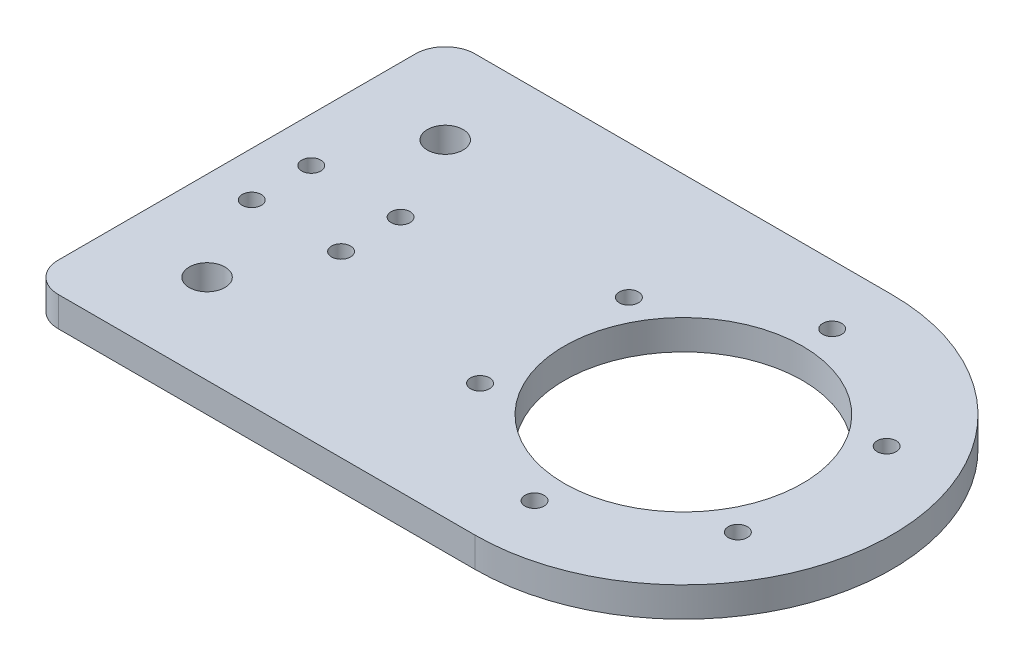
ISO-10303-21;
HEADER;
FILE_DESCRIPTION(('STEP AP214'),'2;1');
FILE_NAME('part.step','',(''),(''),'','','');
FILE_SCHEMA(('AUTOMOTIVE_DESIGN { 1 0 10303 214 1 1 1 1 }'));
ENDSEC;
DATA;
#1=APPLICATION_CONTEXT('core data for automotive mechanical design processes');
#2=APPLICATION_PROTOCOL_DEFINITION('international standard','automotive_design',2000,#1);
#3=PRODUCT_CONTEXT('',#1,'mechanical');
#4=PRODUCT('Part','Part','',(#3));
#5=PRODUCT_RELATED_PRODUCT_CATEGORY('part','',(#4));
#6=PRODUCT_DEFINITION_FORMATION('','',#4);
#7=PRODUCT_DEFINITION_CONTEXT('part definition',#1,'design');
#8=PRODUCT_DEFINITION('design','',#6,#7);
#9=PRODUCT_DEFINITION_SHAPE('','',#8);
#10=(LENGTH_UNIT() NAMED_UNIT(*) SI_UNIT(.MILLI.,.METRE.));
#11=(NAMED_UNIT(*) PLANE_ANGLE_UNIT() SI_UNIT($,.RADIAN.));
#12=(NAMED_UNIT(*) SI_UNIT($,.STERADIAN.) SOLID_ANGLE_UNIT());
#13=UNCERTAINTY_MEASURE_WITH_UNIT(LENGTH_MEASURE(1.E-05),#10,'distance_accuracy_value','');
#14=(GEOMETRIC_REPRESENTATION_CONTEXT(3) GLOBAL_UNCERTAINTY_ASSIGNED_CONTEXT((#13)) GLOBAL_UNIT_ASSIGNED_CONTEXT((#10,
#11,#12)) REPRESENTATION_CONTEXT('',''));
#15=CARTESIAN_POINT('',(0.,0.,0.));
#16=DIRECTION('',(0.,0.,1.));
#17=DIRECTION('',(1.,0.,0.));
#18=AXIS2_PLACEMENT_3D('',#15,#16,#17);
#19=CARTESIAN_POINT('',(0.,5.,-25.));
#20=DIRECTION('',(0.,-1.,0.));
#21=DIRECTION('',(0.,0.,-1.));
#22=AXIS2_PLACEMENT_3D('',#19,#20,#21);
#23=CYLINDRICAL_SURFACE('',#22,1.6);
#24=CARTESIAN_POINT('',(0.,5.,-25.));
#25=DIRECTION('',(0.,1.,0.));
#26=DIRECTION('',(0.,0.,1.));
#27=AXIS2_PLACEMENT_3D('',#24,#25,#26);
#28=CIRCLE('',#27,1.6);
#29=CARTESIAN_POINT('',(0.,5.,-23.4));
#30=VERTEX_POINT('',#29);
#31=EDGE_CURVE('E119',#30,#30,#28,.T.);
#32=ORIENTED_EDGE('',*,*,#31,.T.);
#33=EDGE_LOOP('',(#32));
#34=FACE_BOUND('',#33,.T.);
#35=CARTESIAN_POINT('',(0.,1.5,-25.));
#36=DIRECTION('',(0.,-1.,0.));
#37=DIRECTION('',(0.,0.,-1.));
#38=AXIS2_PLACEMENT_3D('',#35,#36,#37);
#39=CIRCLE('',#38,1.6);
#40=CARTESIAN_POINT('',(0.,1.5,-26.6));
#41=VERTEX_POINT('',#40);
#42=EDGE_CURVE('E37',#41,#41,#39,.T.);
#43=ORIENTED_EDGE('',*,*,#42,.T.);
#44=EDGE_LOOP('',(#43));
#45=FACE_BOUND('',#44,.T.);
#46=ADVANCED_FACE('F33',(#34,#45),#23,.F.);
#47=CARTESIAN_POINT('',(21.650635094611,5.,-12.5));
#48=DIRECTION('',(0.,-1.,0.));
#49=DIRECTION('',(0.,0.,-1.));
#50=AXIS2_PLACEMENT_3D('',#47,#48,#49);
#51=CYLINDRICAL_SURFACE('',#50,1.6);
#52=CARTESIAN_POINT('',(21.650635094611,5.,-12.5));
#53=DIRECTION('',(0.,1.,0.));
#54=DIRECTION('',(0.,0.,1.));
#55=AXIS2_PLACEMENT_3D('',#52,#53,#54);
#56=CIRCLE('',#55,1.6);
#57=CARTESIAN_POINT('',(21.650635094611,5.,-10.8999999999999));
#58=VERTEX_POINT('',#57);
#59=EDGE_CURVE('E208',#58,#58,#56,.T.);
#60=ORIENTED_EDGE('',*,*,#59,.T.);
#61=EDGE_LOOP('',(#60));
#62=FACE_BOUND('',#61,.T.);
#63=CARTESIAN_POINT('',(21.650635094611,1.5,-12.5));
#64=DIRECTION('',(0.,-1.,0.));
#65=DIRECTION('',(0.,0.,-1.));
#66=AXIS2_PLACEMENT_3D('',#63,#64,#65);
#67=CIRCLE('',#66,1.6);
#68=CARTESIAN_POINT('',(21.650635094611,1.5,-14.1));
#69=VERTEX_POINT('',#68);
#70=EDGE_CURVE('E149',#69,#69,#67,.T.);
#71=ORIENTED_EDGE('',*,*,#70,.T.);
#72=EDGE_LOOP('',(#71));
#73=FACE_BOUND('',#72,.T.);
#74=ADVANCED_FACE('F243',(#62,#73),#51,.F.);
#75=CARTESIAN_POINT('',(21.6506350946126,5.,12.4999999999991));
#76=DIRECTION('',(0.,-1.,0.));
#77=DIRECTION('',(0.,0.,-1.));
#78=AXIS2_PLACEMENT_3D('',#75,#76,#77);
#79=CYLINDRICAL_SURFACE('',#78,1.6);
#80=CARTESIAN_POINT('',(21.6506350946126,5.,12.4999999999991));
#81=DIRECTION('',(0.,1.,0.));
#82=DIRECTION('',(0.,0.,1.));
#83=AXIS2_PLACEMENT_3D('',#80,#81,#82);
#84=CIRCLE('',#83,1.6);
#85=CARTESIAN_POINT('',(21.6506350946126,5.,14.0999999999991));
#86=VERTEX_POINT('',#85);
#87=EDGE_CURVE('E205',#86,#86,#84,.T.);
#88=ORIENTED_EDGE('',*,*,#87,.T.);
#89=EDGE_LOOP('',(#88));
#90=FACE_BOUND('',#89,.T.);
#91=CARTESIAN_POINT('',(21.6506350946126,1.5,12.4999999999991));
#92=DIRECTION('',(0.,-1.,0.));
#93=DIRECTION('',(0.,0.,-1.));
#94=AXIS2_PLACEMENT_3D('',#91,#92,#93);
#95=CIRCLE('',#94,1.6);
#96=CARTESIAN_POINT('',(21.6506350946126,1.5,10.8999999999991));
#97=VERTEX_POINT('',#96);
#98=EDGE_CURVE('E147',#97,#97,#95,.T.);
#99=ORIENTED_EDGE('',*,*,#98,.T.);
#100=EDGE_LOOP('',(#99));
#101=FACE_BOUND('',#100,.T.);
#102=ADVANCED_FACE('F249',(#90,#101),#79,.F.);
#103=CARTESIAN_POINT('',(2.1224433562867E-12,5.,25.));
#104=DIRECTION('',(0.,-1.,0.));
#105=DIRECTION('',(0.,0.,-1.));
#106=AXIS2_PLACEMENT_3D('',#103,#104,#105);
#107=CYLINDRICAL_SURFACE('',#106,1.6);
#108=CARTESIAN_POINT('',(2.1224433562867E-12,5.,25.));
#109=DIRECTION('',(0.,1.,0.));
#110=DIRECTION('',(0.,0.,1.));
#111=AXIS2_PLACEMENT_3D('',#108,#109,#110);
#112=CIRCLE('',#111,1.6);
#113=CARTESIAN_POINT('',(2.1224433562867E-12,5.,26.6));
#114=VERTEX_POINT('',#113);
#115=EDGE_CURVE('E202',#114,#114,#112,.T.);
#116=ORIENTED_EDGE('',*,*,#115,.T.);
#117=EDGE_LOOP('',(#116));
#118=FACE_BOUND('',#117,.T.);
#119=CARTESIAN_POINT('',(2.1224433562867E-12,1.5,25.));
#120=DIRECTION('',(0.,-1.,0.));
#121=DIRECTION('',(0.,0.,-1.));
#122=AXIS2_PLACEMENT_3D('',#119,#120,#121);
#123=CIRCLE('',#122,1.6);
#124=CARTESIAN_POINT('',(2.1224433562867E-12,1.5,23.4));
#125=VERTEX_POINT('',#124);
#126=EDGE_CURVE('E144',#125,#125,#123,.T.);
#127=ORIENTED_EDGE('',*,*,#126,.T.);
#128=EDGE_LOOP('',(#127));
#129=FACE_BOUND('',#128,.T.);
#130=ADVANCED_FACE('F472',(#118,#129),#107,.F.);
#131=CARTESIAN_POINT('',(-21.6506350946094,5.,12.5000000000009));
#132=DIRECTION('',(0.,-1.,0.));
#133=DIRECTION('',(0.,0.,-1.));
#134=AXIS2_PLACEMENT_3D('',#131,#132,#133);
#135=CYLINDRICAL_SURFACE('',#134,1.6);
#136=CARTESIAN_POINT('',(-21.6506350946094,5.,12.5000000000009));
#137=DIRECTION('',(0.,1.,0.));
#138=DIRECTION('',(0.,0.,1.));
#139=AXIS2_PLACEMENT_3D('',#136,#137,#138);
#140=CIRCLE('',#139,1.6);
#141=CARTESIAN_POINT('',(-21.6506350946094,5.,14.1000000000009));
#142=VERTEX_POINT('',#141);
#143=EDGE_CURVE('E199',#142,#142,#140,.T.);
#144=ORIENTED_EDGE('',*,*,#143,.T.);
#145=EDGE_LOOP('',(#144));
#146=FACE_BOUND('',#145,.T.);
#147=CARTESIAN_POINT('',(-21.6506350946094,1.5,12.5000000000009));
#148=DIRECTION('',(0.,-1.,0.));
#149=DIRECTION('',(0.,0.,-1.));
#150=AXIS2_PLACEMENT_3D('',#147,#148,#149);
#151=CIRCLE('',#150,1.6);
#152=CARTESIAN_POINT('',(-21.6506350946094,1.5,10.9000000000009));
#153=VERTEX_POINT('',#152);
#154=EDGE_CURVE('E140',#153,#153,#151,.T.);
#155=ORIENTED_EDGE('',*,*,#154,.T.);
#156=EDGE_LOOP('',(#155));
#157=FACE_BOUND('',#156,.T.);
#158=ADVANCED_FACE('F481',(#146,#157),#135,.F.);
#159=CARTESIAN_POINT('',(-21.6506350946104,5.,-12.4999999999991));
#160=DIRECTION('',(0.,-1.,0.));
#161=DIRECTION('',(0.,0.,-1.));
#162=AXIS2_PLACEMENT_3D('',#159,#160,#161);
#163=CYLINDRICAL_SURFACE('',#162,1.6);
#164=CARTESIAN_POINT('',(-21.6506350946104,5.,-12.4999999999991));
#165=DIRECTION('',(0.,1.,0.));
#166=DIRECTION('',(0.,0.,1.));
#167=AXIS2_PLACEMENT_3D('',#164,#165,#166);
#168=CIRCLE('',#167,1.6);
#169=CARTESIAN_POINT('',(-21.6506350946104,5.,-10.8999999999991));
#170=VERTEX_POINT('',#169);
#171=EDGE_CURVE('E194',#170,#170,#168,.T.);
#172=ORIENTED_EDGE('',*,*,#171,.T.);
#173=EDGE_LOOP('',(#172));
#174=FACE_BOUND('',#173,.T.);
#175=CARTESIAN_POINT('',(-21.6506350946104,1.5,-12.4999999999991));
#176=DIRECTION('',(0.,-1.,0.));
#177=DIRECTION('',(0.,0.,-1.));
#178=AXIS2_PLACEMENT_3D('',#175,#176,#177);
#179=CIRCLE('',#178,1.6);
#180=CARTESIAN_POINT('',(-21.6506350946104,1.5,-14.0999999999991));
#181=VERTEX_POINT('',#180);
#182=EDGE_CURVE('E137',#181,#181,#179,.T.);
#183=ORIENTED_EDGE('',*,*,#182,.T.);
#184=EDGE_LOOP('',(#183));
#185=FACE_BOUND('',#184,.T.);
#186=ADVANCED_FACE('F256',(#174,#185),#163,.F.);
#187=CARTESIAN_POINT('',(0.,5.,0.));
#188=DIRECTION('',(0.,-1.,0.));
#189=DIRECTION('',(0.,0.,-1.));
#190=AXIS2_PLACEMENT_3D('',#187,#188,#189);
#191=PLANE('',#190);
#192=DIRECTION('',(-1.,0.,0.));
#193=VECTOR('',#192,1.);
#194=CARTESIAN_POINT('',(-75.,5.,-35.));
#195=LINE('',#194,#193);
#196=CARTESIAN_POINT('',(0.,5.,-35.));
#197=VERTEX_POINT('',#196);
#198=CARTESIAN_POINT('',(-70.,5.,-35.));
#199=VERTEX_POINT('',#198);
#200=EDGE_CURVE('E111',#197,#199,#195,.T.);
#201=ORIENTED_EDGE('',*,*,#200,.T.);
#202=CARTESIAN_POINT('',(-70.,5.,-30.));
#203=DIRECTION('',(0.,-1.,0.));
#204=DIRECTION('',(0.,0.,-1.));
#205=AXIS2_PLACEMENT_3D('',#202,#203,#204);
#206=CIRCLE('',#205,5.);
#207=CARTESIAN_POINT('',(-75.,5.,-30.));
#208=VERTEX_POINT('',#207);
#209=EDGE_CURVE('E42',#199,#208,#206,.F.);
#210=ORIENTED_EDGE('',*,*,#209,.T.);
#211=DIRECTION('',(0.,0.,1.));
#212=VECTOR('',#211,1.);
#213=CARTESIAN_POINT('',(-75.,5.,35.));
#214=LINE('',#213,#212);
#215=CARTESIAN_POINT('',(-75.,5.,30.));
#216=VERTEX_POINT('',#215);
#217=EDGE_CURVE('E97',#208,#216,#214,.T.);
#218=ORIENTED_EDGE('',*,*,#217,.T.);
#219=CARTESIAN_POINT('',(-70.,5.,30.));
#220=DIRECTION('',(0.,-1.,0.));
#221=DIRECTION('',(0.,0.,-1.));
#222=AXIS2_PLACEMENT_3D('',#219,#220,#221);
#223=CIRCLE('',#222,5.);
#224=CARTESIAN_POINT('',(-70.,5.,35.));
#225=VERTEX_POINT('',#224);
#226=EDGE_CURVE('E50',#216,#225,#223,.F.);
#227=ORIENTED_EDGE('',*,*,#226,.T.);
#228=DIRECTION('',(1.,0.,0.));
#229=VECTOR('',#228,1.);
#230=CARTESIAN_POINT('',(0.,5.,35.));
#231=LINE('',#230,#229);
#232=CARTESIAN_POINT('',(0.,5.,35.));
#233=VERTEX_POINT('',#232);
#234=EDGE_CURVE('E88',#225,#233,#231,.T.);
#235=ORIENTED_EDGE('',*,*,#234,.T.);
#236=CARTESIAN_POINT('',(0.,5.,0.));
#237=DIRECTION('',(0.,1.,0.));
#238=DIRECTION('',(0.,0.,-1.));
#239=AXIS2_PLACEMENT_3D('',#236,#237,#238);
#240=CIRCLE('',#239,35.);
#241=EDGE_CURVE('E93',#233,#197,#240,.T.);
#242=ORIENTED_EDGE('',*,*,#241,.T.);
#243=EDGE_LOOP('',(#201,#210,#218,#227,#235,#242));
#244=FACE_BOUND('',#243,.T.);
#245=ORIENTED_EDGE('',*,*,#31,.F.);
#246=EDGE_LOOP('',(#245));
#247=FACE_BOUND('',#246,.T.);
#248=CARTESIAN_POINT('',(0.,5.,0.));
#249=DIRECTION('',(0.,1.,0.));
#250=DIRECTION('',(0.,0.,1.));
#251=AXIS2_PLACEMENT_3D('',#248,#249,#250);
#252=CIRCLE('',#251,20.);
#253=CARTESIAN_POINT('',(0.,5.,20.));
#254=VERTEX_POINT('',#253);
#255=EDGE_CURVE('E212',#254,#254,#252,.T.);
#256=ORIENTED_EDGE('',*,*,#255,.F.);
#257=EDGE_LOOP('',(#256));
#258=FACE_BOUND('',#257,.T.);
#259=ORIENTED_EDGE('',*,*,#59,.F.);
#260=EDGE_LOOP('',(#259));
#261=FACE_BOUND('',#260,.T.);
#262=ORIENTED_EDGE('',*,*,#87,.F.);
#263=EDGE_LOOP('',(#262));
#264=FACE_BOUND('',#263,.T.);
#265=ORIENTED_EDGE('',*,*,#115,.F.);
#266=EDGE_LOOP('',(#265));
#267=FACE_BOUND('',#266,.T.);
#268=ORIENTED_EDGE('',*,*,#143,.F.);
#269=EDGE_LOOP('',(#268));
#270=FACE_BOUND('',#269,.T.);
#271=ORIENTED_EDGE('',*,*,#171,.F.);
#272=EDGE_LOOP('',(#271));
#273=FACE_BOUND('',#272,.T.);
#274=CARTESIAN_POINT('',(-67.5,5.,-5.));
#275=DIRECTION('',(0.,1.,0.));
#276=DIRECTION('',(0.,0.,1.));
#277=AXIS2_PLACEMENT_3D('',#274,#275,#276);
#278=CIRCLE('',#277,1.60000000000001);
#279=CARTESIAN_POINT('',(-67.5,5.,-3.39999999999999));
#280=VERTEX_POINT('',#279);
#281=EDGE_CURVE('E191',#280,#280,#278,.T.);
#282=ORIENTED_EDGE('',*,*,#281,.F.);
#283=EDGE_LOOP('',(#282));
#284=FACE_BOUND('',#283,.T.);
#285=CARTESIAN_POINT('',(-52.5,5.,-5.));
#286=DIRECTION('',(0.,1.,0.));
#287=DIRECTION('',(0.,0.,1.));
#288=AXIS2_PLACEMENT_3D('',#285,#286,#287);
#289=CIRCLE('',#288,1.6);
#290=CARTESIAN_POINT('',(-52.5,5.,-3.4));
#291=VERTEX_POINT('',#290);
#292=EDGE_CURVE('E185',#291,#291,#289,.T.);
#293=ORIENTED_EDGE('',*,*,#292,.F.);
#294=EDGE_LOOP('',(#293));
#295=FACE_BOUND('',#294,.T.);
#296=CARTESIAN_POINT('',(-52.5,5.,5.));
#297=DIRECTION('',(0.,1.,0.));
#298=DIRECTION('',(0.,0.,1.));
#299=AXIS2_PLACEMENT_3D('',#296,#297,#298);
#300=CIRCLE('',#299,1.6);
#301=CARTESIAN_POINT('',(-52.5,5.,6.6));
#302=VERTEX_POINT('',#301);
#303=EDGE_CURVE('E179',#302,#302,#300,.T.);
#304=ORIENTED_EDGE('',*,*,#303,.F.);
#305=EDGE_LOOP('',(#304));
#306=FACE_BOUND('',#305,.T.);
#307=CARTESIAN_POINT('',(-67.5,5.,5.));
#308=DIRECTION('',(0.,1.,0.));
#309=DIRECTION('',(0.,0.,1.));
#310=AXIS2_PLACEMENT_3D('',#307,#308,#309);
#311=CIRCLE('',#310,1.60000000000001);
#312=CARTESIAN_POINT('',(-67.5,5.,6.60000000000001));
#313=VERTEX_POINT('',#312);
#314=EDGE_CURVE('E173',#313,#313,#311,.T.);
#315=ORIENTED_EDGE('',*,*,#314,.F.);
#316=EDGE_LOOP('',(#315));
#317=FACE_BOUND('',#316,.T.);
#318=CARTESIAN_POINT('',(-60.,5.,-20.));
#319=DIRECTION('',(0.,1.,0.));
#320=DIRECTION('',(0.,0.,1.));
#321=AXIS2_PLACEMENT_3D('',#318,#319,#320);
#322=CIRCLE('',#321,3.);
#323=CARTESIAN_POINT('',(-60.,5.,-17.));
#324=VERTEX_POINT('',#323);
#325=EDGE_CURVE('E167',#324,#324,#322,.T.);
#326=ORIENTED_EDGE('',*,*,#325,.F.);
#327=EDGE_LOOP('',(#326));
#328=FACE_BOUND('',#327,.T.);
#329=CARTESIAN_POINT('',(-60.,5.,20.));
#330=DIRECTION('',(0.,1.,0.));
#331=DIRECTION('',(0.,0.,1.));
#332=AXIS2_PLACEMENT_3D('',#329,#330,#331);
#333=CIRCLE('',#332,3.);
#334=CARTESIAN_POINT('',(-60.,5.,23.));
#335=VERTEX_POINT('',#334);
#336=EDGE_CURVE('E158',#335,#335,#333,.T.);
#337=ORIENTED_EDGE('',*,*,#336,.F.);
#338=EDGE_LOOP('',(#337));
#339=FACE_BOUND('',#338,.T.);
#340=ADVANCED_FACE('F90',(#244,#247,#258,#261,#264,#267,#270,#273,#284,#295,#306,#317,#328,
#339),#191,.F.);
#341=CARTESIAN_POINT('',(0.,0.,0.));
#342=DIRECTION('',(0.,-1.,0.));
#343=DIRECTION('',(0.,0.,-1.));
#344=AXIS2_PLACEMENT_3D('',#341,#342,#343);
#345=PLANE('',#344);
#346=CARTESIAN_POINT('',(0.,0.,25.0000000000009));
#347=DIRECTION('',(0.,-1.,0.));
#348=DIRECTION('',(0.,0.,-1.));
#349=AXIS2_PLACEMENT_3D('',#346,#347,#348);
#350=CIRCLE('',#349,3.25);
#351=CARTESIAN_POINT('',(0.,0.,21.7500000000009));
#352=VERTEX_POINT('',#351);
#353=EDGE_CURVE('E575',#352,#352,#350,.T.);
#354=ORIENTED_EDGE('',*,*,#353,.F.);
#355=EDGE_LOOP('',(#354));
#356=FACE_BOUND('',#355,.T.);
#357=CARTESIAN_POINT('',(-21.6506350946112,0.,12.4999999999995));
#358=DIRECTION('',(0.,-1.,0.));
#359=DIRECTION('',(0.,0.,-1.));
#360=AXIS2_PLACEMENT_3D('',#357,#358,#359);
#361=CIRCLE('',#360,3.25000000000107);
#362=CARTESIAN_POINT('',(-21.6506350946112,0.,9.24999999999846));
#363=VERTEX_POINT('',#362);
#364=EDGE_CURVE('E576',#363,#363,#361,.T.);
#365=ORIENTED_EDGE('',*,*,#364,.F.);
#366=EDGE_LOOP('',(#365));
#367=FACE_BOUND('',#366,.T.);
#368=CARTESIAN_POINT('',(-21.6506350946102,0.,-12.5000000000014));
#369=DIRECTION('',(0.,-1.,0.));
#370=DIRECTION('',(0.,0.,-1.));
#371=AXIS2_PLACEMENT_3D('',#368,#369,#370);
#372=CIRCLE('',#371,3.25000000000202);
#373=CARTESIAN_POINT('',(-21.6506350946102,0.,-15.7500000000034));
#374=VERTEX_POINT('',#373);
#375=EDGE_CURVE('E553',#374,#374,#372,.T.);
#376=ORIENTED_EDGE('',*,*,#375,.F.);
#377=EDGE_LOOP('',(#376));
#378=FACE_BOUND('',#377,.T.);
#379=CARTESIAN_POINT('',(2.12244335628677E-12,0.,-25.0000000000009));
#380=DIRECTION('',(0.,-1.,0.));
#381=DIRECTION('',(0.,0.,-1.));
#382=AXIS2_PLACEMENT_3D('',#379,#380,#381);
#383=CIRCLE('',#382,3.2500000000022);
#384=CARTESIAN_POINT('',(2.12244335628677E-12,0.,-28.2500000000031));
#385=VERTEX_POINT('',#384);
#386=EDGE_CURVE('E552',#385,#385,#383,.T.);
#387=ORIENTED_EDGE('',*,*,#386,.F.);
#388=EDGE_LOOP('',(#387));
#389=FACE_BOUND('',#388,.T.);
#390=CARTESIAN_POINT('',(21.6506350946134,0.,-12.4999999999995));
#391=DIRECTION('',(0.,-1.,0.));
#392=DIRECTION('',(0.,0.,-1.));
#393=AXIS2_PLACEMENT_3D('',#390,#391,#392);
#394=CIRCLE('',#393,3.25000000000137);
#395=CARTESIAN_POINT('',(21.6506350946134,0.,-15.7500000000009));
#396=VERTEX_POINT('',#395);
#397=EDGE_CURVE('E563',#396,#396,#394,.T.);
#398=ORIENTED_EDGE('',*,*,#397,.F.);
#399=EDGE_LOOP('',(#398));
#400=FACE_BOUND('',#399,.T.);
#401=CARTESIAN_POINT('',(21.6506350946123,0.,12.5000000000014));
#402=DIRECTION('',(0.,-1.,0.));
#403=DIRECTION('',(0.,0.,-1.));
#404=AXIS2_PLACEMENT_3D('',#401,#402,#403);
#405=CIRCLE('',#404,3.2500000000003);
#406=CARTESIAN_POINT('',(21.6506350946123,0.,9.25000000000109));
#407=VERTEX_POINT('',#406);
#408=EDGE_CURVE('E569',#407,#407,#405,.T.);
#409=ORIENTED_EDGE('',*,*,#408,.F.);
#410=EDGE_LOOP('',(#409));
#411=FACE_BOUND('',#410,.T.);
#412=CARTESIAN_POINT('',(-60.,0.,-20.));
#413=DIRECTION('',(0.,1.,0.));
#414=DIRECTION('',(0.,0.,1.));
#415=AXIS2_PLACEMENT_3D('',#412,#413,#414);
#416=CIRCLE('',#415,3.);
#417=CARTESIAN_POINT('',(-60.,0.,-17.));
#418=VERTEX_POINT('',#417);
#419=EDGE_CURVE('E163',#418,#418,#416,.T.);
#420=ORIENTED_EDGE('',*,*,#419,.T.);
#421=EDGE_LOOP('',(#420));
#422=FACE_BOUND('',#421,.T.);
#423=CARTESIAN_POINT('',(-52.5,0.,5.));
#424=DIRECTION('',(0.,1.,0.));
#425=DIRECTION('',(0.,0.,1.));
#426=AXIS2_PLACEMENT_3D('',#423,#424,#425);
#427=CIRCLE('',#426,1.6);
#428=CARTESIAN_POINT('',(-52.5,0.,6.6));
#429=VERTEX_POINT('',#428);
#430=EDGE_CURVE('E176',#429,#429,#427,.T.);
#431=ORIENTED_EDGE('',*,*,#430,.T.);
#432=EDGE_LOOP('',(#431));
#433=FACE_BOUND('',#432,.T.);
#434=CARTESIAN_POINT('',(-67.5,0.,-5.));
#435=DIRECTION('',(0.,1.,0.));
#436=DIRECTION('',(0.,0.,1.));
#437=AXIS2_PLACEMENT_3D('',#434,#435,#436);
#438=CIRCLE('',#437,1.60000000000001);
#439=CARTESIAN_POINT('',(-67.5,0.,-3.39999999999999));
#440=VERTEX_POINT('',#439);
#441=EDGE_CURVE('E188',#440,#440,#438,.T.);
#442=ORIENTED_EDGE('',*,*,#441,.T.);
#443=EDGE_LOOP('',(#442));
#444=FACE_BOUND('',#443,.T.);
#445=CARTESIAN_POINT('',(0.,0.,0.));
#446=DIRECTION('',(0.,1.,0.));
#447=DIRECTION('',(0.,0.,1.));
#448=AXIS2_PLACEMENT_3D('',#445,#446,#447);
#449=CIRCLE('',#448,20.);
#450=CARTESIAN_POINT('',(0.,0.,20.));
#451=VERTEX_POINT('',#450);
#452=EDGE_CURVE('E211',#451,#451,#449,.T.);
#453=ORIENTED_EDGE('',*,*,#452,.T.);
#454=EDGE_LOOP('',(#453));
#455=FACE_BOUND('',#454,.T.);
#456=DIRECTION('',(0.,0.,1.));
#457=VECTOR('',#456,1.);
#458=CARTESIAN_POINT('',(-75.,0.,35.));
#459=LINE('',#458,#457);
#460=CARTESIAN_POINT('',(-75.,0.,-30.));
#461=VERTEX_POINT('',#460);
#462=CARTESIAN_POINT('',(-75.,0.,30.));
#463=VERTEX_POINT('',#462);
#464=EDGE_CURVE('E116',#461,#463,#459,.T.);
#465=ORIENTED_EDGE('',*,*,#464,.F.);
#466=CARTESIAN_POINT('',(-70.,0.,-30.));
#467=DIRECTION('',(0.,-1.,0.));
#468=DIRECTION('',(0.,0.,-1.));
#469=AXIS2_PLACEMENT_3D('',#466,#467,#468);
#470=CIRCLE('',#469,5.);
#471=CARTESIAN_POINT('',(-70.,0.,-35.));
#472=VERTEX_POINT('',#471);
#473=EDGE_CURVE('E132',#461,#472,#470,.T.);
#474=ORIENTED_EDGE('',*,*,#473,.T.);
#475=DIRECTION('',(-1.,0.,0.));
#476=VECTOR('',#475,1.);
#477=CARTESIAN_POINT('',(-75.,0.,-35.));
#478=LINE('',#477,#476);
#479=CARTESIAN_POINT('',(0.,0.,-35.));
#480=VERTEX_POINT('',#479);
#481=EDGE_CURVE('E123',#480,#472,#478,.T.);
#482=ORIENTED_EDGE('',*,*,#481,.F.);
#483=CARTESIAN_POINT('',(0.,0.,0.));
#484=DIRECTION('',(0.,1.,0.));
#485=DIRECTION('',(0.,0.,-1.));
#486=AXIS2_PLACEMENT_3D('',#483,#484,#485);
#487=CIRCLE('',#486,35.);
#488=CARTESIAN_POINT('',(0.,0.,35.));
#489=VERTEX_POINT('',#488);
#490=EDGE_CURVE('E121',#489,#480,#487,.T.);
#491=ORIENTED_EDGE('',*,*,#490,.F.);
#492=DIRECTION('',(1.,0.,0.));
#493=VECTOR('',#492,1.);
#494=CARTESIAN_POINT('',(0.,0.,35.));
#495=LINE('',#494,#493);
#496=CARTESIAN_POINT('',(-70.,0.,35.));
#497=VERTEX_POINT('',#496);
#498=EDGE_CURVE('E103',#497,#489,#495,.T.);
#499=ORIENTED_EDGE('',*,*,#498,.F.);
#500=CARTESIAN_POINT('',(-70.,0.,30.));
#501=DIRECTION('',(0.,-1.,0.));
#502=DIRECTION('',(0.,0.,-1.));
#503=AXIS2_PLACEMENT_3D('',#500,#501,#502);
#504=CIRCLE('',#503,5.);
#505=EDGE_CURVE('E130',#497,#463,#504,.T.);
#506=ORIENTED_EDGE('',*,*,#505,.T.);
#507=EDGE_LOOP('',(#465,#474,#482,#491,#499,#506));
#508=FACE_BOUND('',#507,.T.);
#509=CARTESIAN_POINT('',(-52.5,0.,-5.));
#510=DIRECTION('',(0.,1.,0.));
#511=DIRECTION('',(0.,0.,1.));
#512=AXIS2_PLACEMENT_3D('',#509,#510,#511);
#513=CIRCLE('',#512,1.6);
#514=CARTESIAN_POINT('',(-52.5,0.,-3.4));
#515=VERTEX_POINT('',#514);
#516=EDGE_CURVE('E182',#515,#515,#513,.T.);
#517=ORIENTED_EDGE('',*,*,#516,.T.);
#518=EDGE_LOOP('',(#517));
#519=FACE_BOUND('',#518,.T.);
#520=CARTESIAN_POINT('',(-67.5,0.,5.));
#521=DIRECTION('',(0.,1.,0.));
#522=DIRECTION('',(0.,0.,1.));
#523=AXIS2_PLACEMENT_3D('',#520,#521,#522);
#524=CIRCLE('',#523,1.60000000000001);
#525=CARTESIAN_POINT('',(-67.5,0.,6.60000000000001));
#526=VERTEX_POINT('',#525);
#527=EDGE_CURVE('E170',#526,#526,#524,.T.);
#528=ORIENTED_EDGE('',*,*,#527,.T.);
#529=EDGE_LOOP('',(#528));
#530=FACE_BOUND('',#529,.T.);
#531=CARTESIAN_POINT('',(-60.,0.,20.));
#532=DIRECTION('',(0.,1.,0.));
#533=DIRECTION('',(0.,0.,1.));
#534=AXIS2_PLACEMENT_3D('',#531,#532,#533);
#535=CIRCLE('',#534,3.);
#536=CARTESIAN_POINT('',(-60.,0.,23.));
#537=VERTEX_POINT('',#536);
#538=EDGE_CURVE('E154',#537,#537,#535,.T.);
#539=ORIENTED_EDGE('',*,*,#538,.T.);
#540=EDGE_LOOP('',(#539));
#541=FACE_BOUND('',#540,.T.);
#542=ADVANCED_FACE('F226',(#356,#367,#378,#389,#400,#411,#422,#433,#444,#455,#508,#519,#530,
#541),#345,.T.);
#543=CARTESIAN_POINT('',(-75.,5.,35.));
#544=DIRECTION('',(1.,0.,0.));
#545=DIRECTION('',(0.,0.,-1.));
#546=AXIS2_PLACEMENT_3D('',#543,#544,#545);
#547=PLANE('',#546);
#548=ORIENTED_EDGE('',*,*,#217,.F.);
#549=DIRECTION('',(0.,-1.,0.));
#550=VECTOR('',#549,1.);
#551=CARTESIAN_POINT('',(-75.,5.,-30.));
#552=LINE('',#551,#550);
#553=EDGE_CURVE('E127',#208,#461,#552,.T.);
#554=ORIENTED_EDGE('',*,*,#553,.T.);
#555=ORIENTED_EDGE('',*,*,#464,.T.);
#556=DIRECTION('',(0.,-1.,0.));
#557=VECTOR('',#556,1.);
#558=CARTESIAN_POINT('',(-75.,5.,30.));
#559=LINE('',#558,#557);
#560=EDGE_CURVE('E106',#463,#216,#559,.F.);
#561=ORIENTED_EDGE('',*,*,#560,.T.);
#562=EDGE_LOOP('',(#548,#554,#555,#561));
#563=FACE_BOUND('',#562,.T.);
#564=ADVANCED_FACE('F232',(#563),#547,.F.);
#565=CARTESIAN_POINT('',(0.,5.,35.));
#566=DIRECTION('',(0.,0.,-1.));
#567=DIRECTION('',(-1.,0.,0.));
#568=AXIS2_PLACEMENT_3D('',#565,#566,#567);
#569=PLANE('',#568);
#570=ORIENTED_EDGE('',*,*,#234,.F.);
#571=DIRECTION('',(0.,-1.,0.));
#572=VECTOR('',#571,1.);
#573=CARTESIAN_POINT('',(-70.,5.,35.));
#574=LINE('',#573,#572);
#575=EDGE_CURVE('E11',#225,#497,#574,.T.);
#576=ORIENTED_EDGE('',*,*,#575,.T.);
#577=ORIENTED_EDGE('',*,*,#498,.T.);
#578=DIRECTION('',(0.,-1.,0.));
#579=VECTOR('',#578,1.);
#580=CARTESIAN_POINT('',(0.,5.,35.));
#581=LINE('',#580,#579);
#582=EDGE_CURVE('E100',#233,#489,#581,.T.);
#583=ORIENTED_EDGE('',*,*,#582,.F.);
#584=EDGE_LOOP('',(#570,#576,#577,#583));
#585=FACE_BOUND('',#584,.T.);
#586=ADVANCED_FACE('F101',(#585),#569,.F.);
#587=CARTESIAN_POINT('',(0.,5.,0.));
#588=DIRECTION('',(0.,-1.,0.));
#589=DIRECTION('',(0.,0.,-1.));
#590=AXIS2_PLACEMENT_3D('',#587,#588,#589);
#591=CYLINDRICAL_SURFACE('',#590,35.);
#592=ORIENTED_EDGE('',*,*,#490,.T.);
#593=DIRECTION('',(0.,-1.,0.));
#594=VECTOR('',#593,1.);
#595=CARTESIAN_POINT('',(0.,5.,-35.));
#596=LINE('',#595,#594);
#597=EDGE_CURVE('E107',#197,#480,#596,.T.);
#598=ORIENTED_EDGE('',*,*,#597,.F.);
#599=ORIENTED_EDGE('',*,*,#241,.F.);
#600=ORIENTED_EDGE('',*,*,#582,.T.);
#601=EDGE_LOOP('',(#592,#598,#599,#600));
#602=FACE_BOUND('',#601,.T.);
#603=ADVANCED_FACE('F109',(#602),#591,.T.);
#604=CARTESIAN_POINT('',(-75.,5.,-35.));
#605=DIRECTION('',(0.,0.,1.));
#606=DIRECTION('',(1.,0.,0.));
#607=AXIS2_PLACEMENT_3D('',#604,#605,#606);
#608=PLANE('',#607);
#609=ORIENTED_EDGE('',*,*,#481,.T.);
#610=DIRECTION('',(0.,-1.,0.));
#611=VECTOR('',#610,1.);
#612=CARTESIAN_POINT('',(-70.,5.,-35.));
#613=LINE('',#612,#611);
#614=EDGE_CURVE('E58',#472,#199,#613,.F.);
#615=ORIENTED_EDGE('',*,*,#614,.T.);
#616=ORIENTED_EDGE('',*,*,#200,.F.);
#617=ORIENTED_EDGE('',*,*,#597,.T.);
#618=EDGE_LOOP('',(#609,#615,#616,#617));
#619=FACE_BOUND('',#618,.T.);
#620=ADVANCED_FACE('F229',(#619),#608,.F.);
#621=CARTESIAN_POINT('',(0.,5.,0.));
#622=DIRECTION('',(0.,-1.,0.));
#623=DIRECTION('',(0.,0.,-1.));
#624=AXIS2_PLACEMENT_3D('',#621,#622,#623);
#625=CYLINDRICAL_SURFACE('',#624,20.);
#626=ORIENTED_EDGE('',*,*,#255,.T.);
#627=EDGE_LOOP('',(#626));
#628=FACE_BOUND('',#627,.T.);
#629=ORIENTED_EDGE('',*,*,#452,.F.);
#630=EDGE_LOOP('',(#629));
#631=FACE_BOUND('',#630,.T.);
#632=ADVANCED_FACE('F254',(#628,#631),#625,.F.);
#633=CARTESIAN_POINT('',(-67.5,5.,-5.));
#634=DIRECTION('',(0.,-1.,0.));
#635=DIRECTION('',(0.,0.,-1.));
#636=AXIS2_PLACEMENT_3D('',#633,#634,#635);
#637=CYLINDRICAL_SURFACE('',#636,1.60000000000001);
#638=ORIENTED_EDGE('',*,*,#281,.T.);
#639=EDGE_LOOP('',(#638));
#640=FACE_BOUND('',#639,.T.);
#641=ORIENTED_EDGE('',*,*,#441,.F.);
#642=EDGE_LOOP('',(#641));
#643=FACE_BOUND('',#642,.T.);
#644=ADVANCED_FACE('F276',(#640,#643),#637,.F.);
#645=CARTESIAN_POINT('',(-52.5,5.,-5.));
#646=DIRECTION('',(0.,-1.,0.));
#647=DIRECTION('',(0.,0.,-1.));
#648=AXIS2_PLACEMENT_3D('',#645,#646,#647);
#649=CYLINDRICAL_SURFACE('',#648,1.6);
#650=ORIENTED_EDGE('',*,*,#292,.T.);
#651=EDGE_LOOP('',(#650));
#652=FACE_BOUND('',#651,.T.);
#653=ORIENTED_EDGE('',*,*,#516,.F.);
#654=EDGE_LOOP('',(#653));
#655=FACE_BOUND('',#654,.T.);
#656=ADVANCED_FACE('F283',(#652,#655),#649,.F.);
#657=CARTESIAN_POINT('',(-52.5,5.,5.));
#658=DIRECTION('',(0.,-1.,0.));
#659=DIRECTION('',(0.,0.,-1.));
#660=AXIS2_PLACEMENT_3D('',#657,#658,#659);
#661=CYLINDRICAL_SURFACE('',#660,1.6);
#662=ORIENTED_EDGE('',*,*,#303,.T.);
#663=EDGE_LOOP('',(#662));
#664=FACE_BOUND('',#663,.T.);
#665=ORIENTED_EDGE('',*,*,#430,.F.);
#666=EDGE_LOOP('',(#665));
#667=FACE_BOUND('',#666,.T.);
#668=ADVANCED_FACE('F291',(#664,#667),#661,.F.);
#669=CARTESIAN_POINT('',(-67.5,5.,5.));
#670=DIRECTION('',(0.,-1.,0.));
#671=DIRECTION('',(0.,0.,-1.));
#672=AXIS2_PLACEMENT_3D('',#669,#670,#671);
#673=CYLINDRICAL_SURFACE('',#672,1.60000000000001);
#674=ORIENTED_EDGE('',*,*,#314,.T.);
#675=EDGE_LOOP('',(#674));
#676=FACE_BOUND('',#675,.T.);
#677=ORIENTED_EDGE('',*,*,#527,.F.);
#678=EDGE_LOOP('',(#677));
#679=FACE_BOUND('',#678,.T.);
#680=ADVANCED_FACE('F299',(#676,#679),#673,.F.);
#681=CARTESIAN_POINT('',(-60.,5.,-20.));
#682=DIRECTION('',(0.,-1.,0.));
#683=DIRECTION('',(0.,0.,-1.));
#684=AXIS2_PLACEMENT_3D('',#681,#682,#683);
#685=CYLINDRICAL_SURFACE('',#684,3.);
#686=ORIENTED_EDGE('',*,*,#325,.T.);
#687=EDGE_LOOP('',(#686));
#688=FACE_BOUND('',#687,.T.);
#689=ORIENTED_EDGE('',*,*,#419,.F.);
#690=EDGE_LOOP('',(#689));
#691=FACE_BOUND('',#690,.T.);
#692=ADVANCED_FACE('F307',(#688,#691),#685,.F.);
#693=CARTESIAN_POINT('',(-60.,5.,20.));
#694=DIRECTION('',(0.,-1.,0.));
#695=DIRECTION('',(0.,0.,-1.));
#696=AXIS2_PLACEMENT_3D('',#693,#694,#695);
#697=CYLINDRICAL_SURFACE('',#696,3.);
#698=ORIENTED_EDGE('',*,*,#336,.T.);
#699=EDGE_LOOP('',(#698));
#700=FACE_BOUND('',#699,.T.);
#701=ORIENTED_EDGE('',*,*,#538,.F.);
#702=EDGE_LOOP('',(#701));
#703=FACE_BOUND('',#702,.T.);
#704=ADVANCED_FACE('F315',(#700,#703),#697,.F.);
#705=CARTESIAN_POINT('',(-70.,5.,-30.));
#706=DIRECTION('',(0.,-1.,0.));
#707=DIRECTION('',(0.,0.,-1.));
#708=AXIS2_PLACEMENT_3D('',#705,#706,#707);
#709=CYLINDRICAL_SURFACE('',#708,5.);
#710=ORIENTED_EDGE('',*,*,#209,.F.);
#711=ORIENTED_EDGE('',*,*,#614,.F.);
#712=ORIENTED_EDGE('',*,*,#473,.F.);
#713=ORIENTED_EDGE('',*,*,#553,.F.);
#714=EDGE_LOOP('',(#710,#711,#712,#713));
#715=FACE_BOUND('',#714,.T.);
#716=ADVANCED_FACE('F231',(#715),#709,.T.);
#717=CARTESIAN_POINT('',(-70.,5.,30.));
#718=DIRECTION('',(0.,-1.,0.));
#719=DIRECTION('',(0.,0.,-1.));
#720=AXIS2_PLACEMENT_3D('',#717,#718,#719);
#721=CYLINDRICAL_SURFACE('',#720,5.);
#722=ORIENTED_EDGE('',*,*,#226,.F.);
#723=ORIENTED_EDGE('',*,*,#560,.F.);
#724=ORIENTED_EDGE('',*,*,#505,.F.);
#725=ORIENTED_EDGE('',*,*,#575,.F.);
#726=EDGE_LOOP('',(#722,#723,#724,#725));
#727=FACE_BOUND('',#726,.T.);
#728=ADVANCED_FACE('F35',(#727),#721,.T.);
#729=CARTESIAN_POINT('',(-21.6506350946102,1.5,-12.5000000000014));
#730=DIRECTION('',(0.,-1.,0.));
#731=DIRECTION('',(0.,0.,-1.));
#732=AXIS2_PLACEMENT_3D('',#729,#730,#731);
#733=CYLINDRICAL_SURFACE('',#732,3.25000000000202);
#734=CARTESIAN_POINT('',(-21.6506350946102,1.5,-12.5000000000014));
#735=DIRECTION('',(0.,-1.,0.));
#736=DIRECTION('',(0.,0.,-1.));
#737=AXIS2_PLACEMENT_3D('',#734,#735,#736);
#738=CIRCLE('',#737,3.25000000000202);
#739=CARTESIAN_POINT('',(-21.6506350946102,1.5,-15.7500000000034));
#740=VERTEX_POINT('',#739);
#741=EDGE_CURVE('E551',#740,#740,#738,.T.);
#742=ORIENTED_EDGE('',*,*,#741,.F.);
#743=EDGE_LOOP('',(#742));
#744=FACE_BOUND('',#743,.T.);
#745=ORIENTED_EDGE('',*,*,#375,.T.);
#746=EDGE_LOOP('',(#745));
#747=FACE_BOUND('',#746,.T.);
#748=ADVANCED_FACE('F335',(#744,#747),#733,.F.);
#749=CARTESIAN_POINT('',(-21.6506350946102,1.5,-12.5000000000014));
#750=DIRECTION('',(0.,-1.,0.));
#751=DIRECTION('',(0.,0.,-1.));
#752=AXIS2_PLACEMENT_3D('',#749,#750,#751);
#753=PLANE('',#752);
#754=ORIENTED_EDGE('',*,*,#182,.F.);
#755=EDGE_LOOP('',(#754));
#756=FACE_BOUND('',#755,.T.);
#757=ORIENTED_EDGE('',*,*,#741,.T.);
#758=EDGE_LOOP('',(#757));
#759=FACE_BOUND('',#758,.T.);
#760=ADVANCED_FACE('F341',(#756,#759),#753,.T.);
#761=CARTESIAN_POINT('',(-21.6506350946112,1.5,12.4999999999995));
#762=DIRECTION('',(0.,-1.,0.));
#763=DIRECTION('',(0.,0.,-1.));
#764=AXIS2_PLACEMENT_3D('',#761,#762,#763);
#765=CYLINDRICAL_SURFACE('',#764,3.25000000000107);
#766=CARTESIAN_POINT('',(-21.6506350946112,1.5,12.4999999999995));
#767=DIRECTION('',(0.,-1.,0.));
#768=DIRECTION('',(0.,0.,-1.));
#769=AXIS2_PLACEMENT_3D('',#766,#767,#768);
#770=CIRCLE('',#769,3.25000000000107);
#771=CARTESIAN_POINT('',(-21.6506350946112,1.5,9.24999999999846));
#772=VERTEX_POINT('',#771);
#773=EDGE_CURVE('E559',#772,#772,#770,.T.);
#774=ORIENTED_EDGE('',*,*,#773,.F.);
#775=EDGE_LOOP('',(#774));
#776=FACE_BOUND('',#775,.T.);
#777=ORIENTED_EDGE('',*,*,#364,.T.);
#778=EDGE_LOOP('',(#777));
#779=FACE_BOUND('',#778,.T.);
#780=ADVANCED_FACE('F350',(#776,#779),#765,.F.);
#781=CARTESIAN_POINT('',(-21.6506350946112,1.5,12.4999999999995));
#782=DIRECTION('',(0.,-1.,0.));
#783=DIRECTION('',(0.,0.,-1.));
#784=AXIS2_PLACEMENT_3D('',#781,#782,#783);
#785=PLANE('',#784);
#786=ORIENTED_EDGE('',*,*,#154,.F.);
#787=EDGE_LOOP('',(#786));
#788=FACE_BOUND('',#787,.T.);
#789=ORIENTED_EDGE('',*,*,#773,.T.);
#790=EDGE_LOOP('',(#789));
#791=FACE_BOUND('',#790,.T.);
#792=ADVANCED_FACE('F358',(#788,#791),#785,.T.);
#793=CARTESIAN_POINT('',(0.,1.5,25.0000000000009));
#794=DIRECTION('',(0.,-1.,0.));
#795=DIRECTION('',(0.,0.,-1.));
#796=AXIS2_PLACEMENT_3D('',#793,#794,#795);
#797=CYLINDRICAL_SURFACE('',#796,3.25);
#798=CARTESIAN_POINT('',(0.,1.5,25.0000000000009));
#799=DIRECTION('',(0.,-1.,0.));
#800=DIRECTION('',(0.,0.,-1.));
#801=AXIS2_PLACEMENT_3D('',#798,#799,#800);
#802=CIRCLE('',#801,3.25);
#803=CARTESIAN_POINT('',(0.,1.5,21.7500000000009));
#804=VERTEX_POINT('',#803);
#805=EDGE_CURVE('E141',#804,#804,#802,.T.);
#806=ORIENTED_EDGE('',*,*,#805,.F.);
#807=EDGE_LOOP('',(#806));
#808=FACE_BOUND('',#807,.T.);
#809=ORIENTED_EDGE('',*,*,#353,.T.);
#810=EDGE_LOOP('',(#809));
#811=FACE_BOUND('',#810,.T.);
#812=ADVANCED_FACE('F366',(#808,#811),#797,.F.);
#813=CARTESIAN_POINT('',(0.,1.5,25.0000000000009));
#814=DIRECTION('',(0.,-1.,0.));
#815=DIRECTION('',(0.,0.,-1.));
#816=AXIS2_PLACEMENT_3D('',#813,#814,#815);
#817=PLANE('',#816);
#818=ORIENTED_EDGE('',*,*,#126,.F.);
#819=EDGE_LOOP('',(#818));
#820=FACE_BOUND('',#819,.T.);
#821=ORIENTED_EDGE('',*,*,#805,.T.);
#822=EDGE_LOOP('',(#821));
#823=FACE_BOUND('',#822,.T.);
#824=ADVANCED_FACE('F374',(#820,#823),#817,.T.);
#825=CARTESIAN_POINT('',(21.6506350946123,1.5,12.5000000000014));
#826=DIRECTION('',(0.,-1.,0.));
#827=DIRECTION('',(0.,0.,-1.));
#828=AXIS2_PLACEMENT_3D('',#825,#826,#827);
#829=CYLINDRICAL_SURFACE('',#828,3.2500000000003);
#830=CARTESIAN_POINT('',(21.6506350946123,1.5,12.5000000000014));
#831=DIRECTION('',(0.,-1.,0.));
#832=DIRECTION('',(0.,0.,-1.));
#833=AXIS2_PLACEMENT_3D('',#830,#831,#832);
#834=CIRCLE('',#833,3.2500000000003);
#835=CARTESIAN_POINT('',(21.6506350946123,1.5,9.25000000000109));
#836=VERTEX_POINT('',#835);
#837=EDGE_CURVE('E572',#836,#836,#834,.T.);
#838=ORIENTED_EDGE('',*,*,#837,.F.);
#839=EDGE_LOOP('',(#838));
#840=FACE_BOUND('',#839,.T.);
#841=ORIENTED_EDGE('',*,*,#408,.T.);
#842=EDGE_LOOP('',(#841));
#843=FACE_BOUND('',#842,.T.);
#844=ADVANCED_FACE('F382',(#840,#843),#829,.F.);
#845=CARTESIAN_POINT('',(21.6506350946123,1.5,12.5000000000014));
#846=DIRECTION('',(0.,-1.,0.));
#847=DIRECTION('',(0.,0.,-1.));
#848=AXIS2_PLACEMENT_3D('',#845,#846,#847);
#849=PLANE('',#848);
#850=ORIENTED_EDGE('',*,*,#98,.F.);
#851=EDGE_LOOP('',(#850));
#852=FACE_BOUND('',#851,.T.);
#853=ORIENTED_EDGE('',*,*,#837,.T.);
#854=EDGE_LOOP('',(#853));
#855=FACE_BOUND('',#854,.T.);
#856=ADVANCED_FACE('F390',(#852,#855),#849,.T.);
#857=CARTESIAN_POINT('',(21.6506350946134,1.5,-12.4999999999995));
#858=DIRECTION('',(0.,-1.,0.));
#859=DIRECTION('',(0.,0.,-1.));
#860=AXIS2_PLACEMENT_3D('',#857,#858,#859);
#861=CYLINDRICAL_SURFACE('',#860,3.25000000000137);
#862=CARTESIAN_POINT('',(21.6506350946134,1.5,-12.4999999999995));
#863=DIRECTION('',(0.,-1.,0.));
#864=DIRECTION('',(0.,0.,-1.));
#865=AXIS2_PLACEMENT_3D('',#862,#863,#864);
#866=CIRCLE('',#865,3.25000000000137);
#867=CARTESIAN_POINT('',(21.6506350946134,1.5,-15.7500000000009));
#868=VERTEX_POINT('',#867);
#869=EDGE_CURVE('E566',#868,#868,#866,.T.);
#870=ORIENTED_EDGE('',*,*,#869,.F.);
#871=EDGE_LOOP('',(#870));
#872=FACE_BOUND('',#871,.T.);
#873=ORIENTED_EDGE('',*,*,#397,.T.);
#874=EDGE_LOOP('',(#873));
#875=FACE_BOUND('',#874,.T.);
#876=ADVANCED_FACE('F398',(#872,#875),#861,.F.);
#877=CARTESIAN_POINT('',(21.6506350946134,1.5,-12.4999999999995));
#878=DIRECTION('',(0.,-1.,0.));
#879=DIRECTION('',(0.,0.,-1.));
#880=AXIS2_PLACEMENT_3D('',#877,#878,#879);
#881=PLANE('',#880);
#882=ORIENTED_EDGE('',*,*,#70,.F.);
#883=EDGE_LOOP('',(#882));
#884=FACE_BOUND('',#883,.T.);
#885=ORIENTED_EDGE('',*,*,#869,.T.);
#886=EDGE_LOOP('',(#885));
#887=FACE_BOUND('',#886,.T.);
#888=ADVANCED_FACE('F406',(#884,#887),#881,.T.);
#889=CARTESIAN_POINT('',(2.12244335628677E-12,1.5,-25.0000000000009));
#890=DIRECTION('',(0.,-1.,0.));
#891=DIRECTION('',(0.,0.,-1.));
#892=AXIS2_PLACEMENT_3D('',#889,#890,#891);
#893=CYLINDRICAL_SURFACE('',#892,3.2500000000022);
#894=CARTESIAN_POINT('',(2.12244335628677E-12,1.5,-25.0000000000009));
#895=DIRECTION('',(0.,-1.,0.));
#896=DIRECTION('',(0.,0.,-1.));
#897=AXIS2_PLACEMENT_3D('',#894,#895,#896);
#898=CIRCLE('',#897,3.2500000000022);
#899=CARTESIAN_POINT('',(2.12244335628677E-12,1.5,-28.2500000000031));
#900=VERTEX_POINT('',#899);
#901=EDGE_CURVE('E556',#900,#900,#898,.T.);
#902=ORIENTED_EDGE('',*,*,#901,.F.);
#903=EDGE_LOOP('',(#902));
#904=FACE_BOUND('',#903,.T.);
#905=ORIENTED_EDGE('',*,*,#386,.T.);
#906=EDGE_LOOP('',(#905));
#907=FACE_BOUND('',#906,.T.);
#908=ADVANCED_FACE('F414',(#904,#907),#893,.F.);
#909=CARTESIAN_POINT('',(2.12244335628677E-12,1.5,-25.0000000000009));
#910=DIRECTION('',(0.,-1.,0.));
#911=DIRECTION('',(0.,0.,-1.));
#912=AXIS2_PLACEMENT_3D('',#909,#910,#911);
#913=PLANE('',#912);
#914=ORIENTED_EDGE('',*,*,#42,.F.);
#915=EDGE_LOOP('',(#914));
#916=FACE_BOUND('',#915,.T.);
#917=ORIENTED_EDGE('',*,*,#901,.T.);
#918=EDGE_LOOP('',(#917));
#919=FACE_BOUND('',#918,.T.);
#920=ADVANCED_FACE('F422',(#916,#919),#913,.T.);
#921=CLOSED_SHELL('',(#46,#74,#102,#130,#158,#186,#340,#542,#564,#586,#603,#620,#632,#644,#656,
#668,#680,#692,#704,#716,#728,#748,#760,#780,#792,#812,#824,#844,#856,#876,#888,#908,#920));
#922=MANIFOLD_SOLID_BREP('B2',#921);
#923=ADVANCED_BREP_SHAPE_REPRESENTATION('',(#18,#922),#14);
#924=SHAPE_DEFINITION_REPRESENTATION(#9,#923);
ENDSEC;
END-ISO-10303-21;
